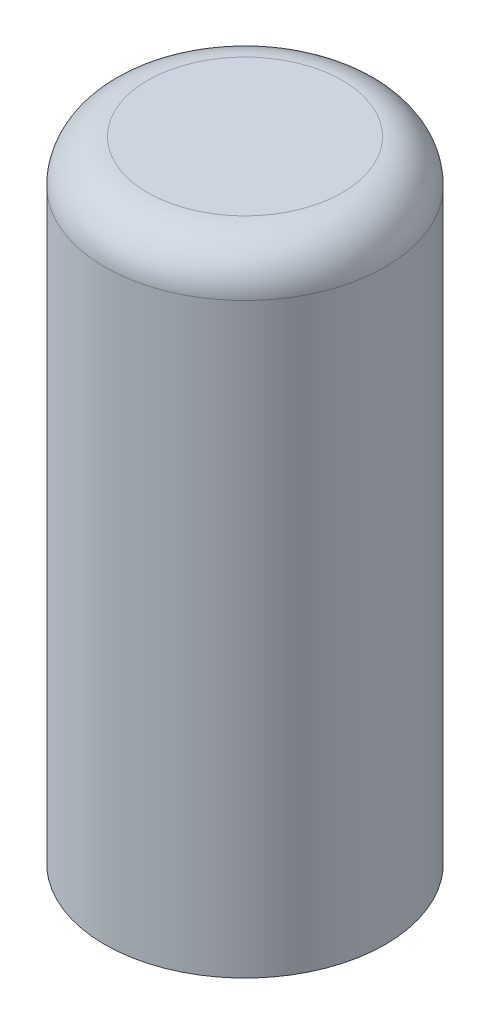
ISO-10303-21;
HEADER;
FILE_DESCRIPTION(('STEP AP214'),'2;1');
FILE_NAME('part.step','',(''),(''),'','','');
FILE_SCHEMA(('AUTOMOTIVE_DESIGN { 1 0 10303 214 1 1 1 1 }'));
ENDSEC;
DATA;
#1=APPLICATION_CONTEXT('core data for automotive mechanical design processes');
#2=APPLICATION_PROTOCOL_DEFINITION('international standard','automotive_design',2000,#1);
#3=PRODUCT_CONTEXT('',#1,'mechanical');
#4=PRODUCT('Part','Part','',(#3));
#5=PRODUCT_RELATED_PRODUCT_CATEGORY('part','',(#4));
#6=PRODUCT_DEFINITION_FORMATION('','',#4);
#7=PRODUCT_DEFINITION_CONTEXT('part definition',#1,'design');
#8=PRODUCT_DEFINITION('design','',#6,#7);
#9=PRODUCT_DEFINITION_SHAPE('','',#8);
#10=(LENGTH_UNIT() NAMED_UNIT(*) SI_UNIT(.MILLI.,.METRE.));
#11=(NAMED_UNIT(*) PLANE_ANGLE_UNIT() SI_UNIT($,.RADIAN.));
#12=(NAMED_UNIT(*) SI_UNIT($,.STERADIAN.) SOLID_ANGLE_UNIT());
#13=UNCERTAINTY_MEASURE_WITH_UNIT(LENGTH_MEASURE(1.E-05),#10,'distance_accuracy_value','');
#14=(GEOMETRIC_REPRESENTATION_CONTEXT(3) GLOBAL_UNCERTAINTY_ASSIGNED_CONTEXT((#13)) GLOBAL_UNIT_ASSIGNED_CONTEXT((#10,
#11,#12)) REPRESENTATION_CONTEXT('',''));
#15=CARTESIAN_POINT('',(0.,0.,0.));
#16=DIRECTION('',(0.,0.,1.));
#17=DIRECTION('',(1.,0.,0.));
#18=AXIS2_PLACEMENT_3D('',#15,#16,#17);
#19=CARTESIAN_POINT('',(0.,22.,0.));
#20=DIRECTION('',(0.,-1.,0.));
#21=DIRECTION('',(0.,0.,-1.));
#22=AXIS2_PLACEMENT_3D('',#19,#20,#21);
#23=CYLINDRICAL_SURFACE('',#22,4.9);
#24=CARTESIAN_POINT('',(0.,20.5,0.));
#25=DIRECTION('',(0.,1.,0.));
#26=DIRECTION('',(0.,0.,1.));
#27=AXIS2_PLACEMENT_3D('',#24,#25,#26);
#28=CIRCLE('',#27,4.9);
#29=CARTESIAN_POINT('',(0.,20.5,4.9));
#30=VERTEX_POINT('',#29);
#31=EDGE_CURVE('E10',#30,#30,#28,.F.);
#32=ORIENTED_EDGE('',*,*,#31,.T.);
#33=EDGE_LOOP('',(#32));
#34=FACE_BOUND('',#33,.T.);
#35=CARTESIAN_POINT('',(0.,0.,0.));
#36=DIRECTION('',(0.,1.,0.));
#37=DIRECTION('',(0.,0.,1.));
#38=AXIS2_PLACEMENT_3D('',#35,#36,#37);
#39=CIRCLE('',#38,4.9);
#40=CARTESIAN_POINT('',(0.,0.,4.9));
#41=VERTEX_POINT('',#40);
#42=EDGE_CURVE('E46',#41,#41,#39,.T.);
#43=ORIENTED_EDGE('',*,*,#42,.T.);
#44=EDGE_LOOP('',(#43));
#45=FACE_BOUND('',#44,.T.);
#46=ADVANCED_FACE('F35',(#34,#45),#23,.T.);
#47=CARTESIAN_POINT('',(0.,22.,0.));
#48=DIRECTION('',(0.,1.,0.));
#49=DIRECTION('',(0.,0.,1.));
#50=AXIS2_PLACEMENT_3D('',#47,#48,#49);
#51=PLANE('',#50);
#52=CARTESIAN_POINT('',(0.,22.,0.));
#53=DIRECTION('',(0.,1.,0.));
#54=DIRECTION('',(0.,0.,1.));
#55=AXIS2_PLACEMENT_3D('',#52,#53,#54);
#56=CIRCLE('',#55,3.4);
#57=CARTESIAN_POINT('',(0.,22.,3.4));
#58=VERTEX_POINT('',#57);
#59=EDGE_CURVE('E42',#58,#58,#56,.T.);
#60=ORIENTED_EDGE('',*,*,#59,.T.);
#61=EDGE_LOOP('',(#60));
#62=FACE_BOUND('',#61,.T.);
#63=ADVANCED_FACE('F56',(#62),#51,.T.);
#64=CARTESIAN_POINT('',(0.,0.,0.));
#65=DIRECTION('',(0.,1.,0.));
#66=DIRECTION('',(0.,0.,1.));
#67=AXIS2_PLACEMENT_3D('',#64,#65,#66);
#68=PLANE('',#67);
#69=ORIENTED_EDGE('',*,*,#42,.F.);
#70=EDGE_LOOP('',(#69));
#71=FACE_BOUND('',#70,.T.);
#72=ADVANCED_FACE('F54',(#71),#68,.F.);
#73=CARTESIAN_POINT('',(0.,20.5,0.));
#74=DIRECTION('',(0.,1.,0.));
#75=DIRECTION('',(0.,0.,1.));
#76=AXIS2_PLACEMENT_3D('',#73,#74,#75);
#77=TOROIDAL_SURFACE('',#76,3.4,1.5);
#78=ORIENTED_EDGE('',*,*,#31,.F.);
#79=EDGE_LOOP('',(#78));
#80=FACE_BOUND('',#79,.T.);
#81=ORIENTED_EDGE('',*,*,#59,.F.);
#82=EDGE_LOOP('',(#81));
#83=FACE_BOUND('',#82,.T.);
#84=ADVANCED_FACE('F37',(#80,#83),#77,.T.);
#85=CLOSED_SHELL('',(#46,#63,#72,#84));
#86=MANIFOLD_SOLID_BREP('B2',#85);
#87=ADVANCED_BREP_SHAPE_REPRESENTATION('',(#18,#86),#14);
#88=SHAPE_DEFINITION_REPRESENTATION(#9,#87);
ENDSEC;
END-ISO-10303-21;
